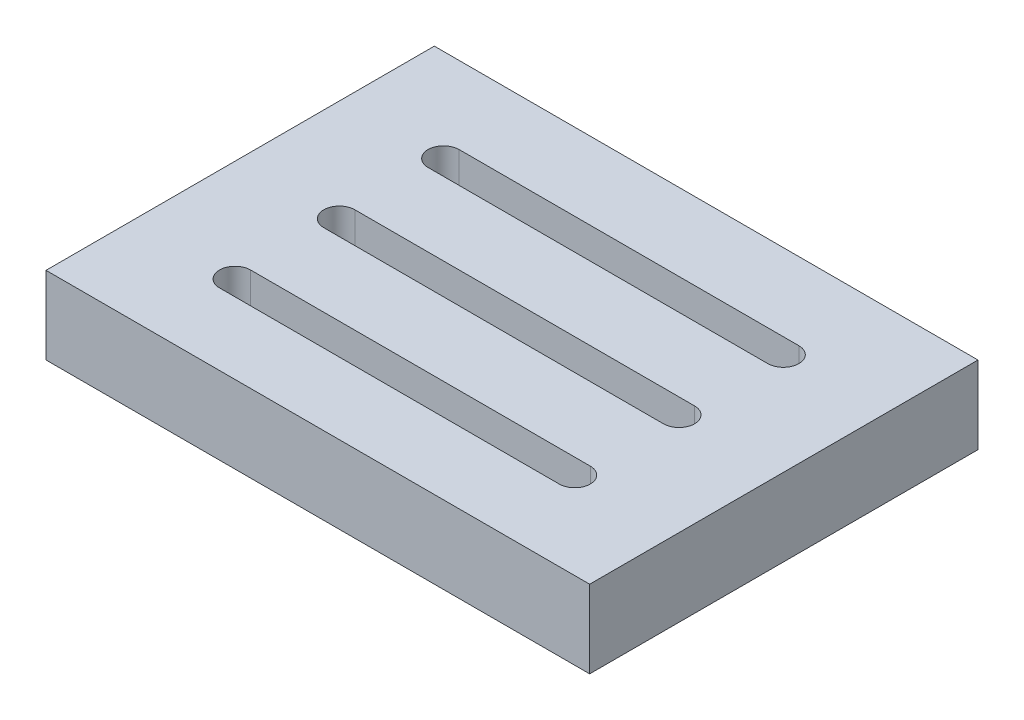
ISO-10303-21;
HEADER;
FILE_DESCRIPTION(('STEP AP214'),'2;1');
FILE_NAME('part.step','',(''),(''),'','','');
FILE_SCHEMA(('AUTOMOTIVE_DESIGN { 1 0 10303 214 1 1 1 1 }'));
ENDSEC;
DATA;
#1=APPLICATION_CONTEXT('core data for automotive mechanical design processes');
#2=APPLICATION_PROTOCOL_DEFINITION('international standard','automotive_design',2000,#1);
#3=PRODUCT_CONTEXT('',#1,'mechanical');
#4=PRODUCT('Part','Part','',(#3));
#5=PRODUCT_RELATED_PRODUCT_CATEGORY('part','',(#4));
#6=PRODUCT_DEFINITION_FORMATION('','',#4);
#7=PRODUCT_DEFINITION_CONTEXT('part definition',#1,'design');
#8=PRODUCT_DEFINITION('design','',#6,#7);
#9=PRODUCT_DEFINITION_SHAPE('','',#8);
#10=(LENGTH_UNIT() NAMED_UNIT(*) SI_UNIT(.MILLI.,.METRE.));
#11=(NAMED_UNIT(*) PLANE_ANGLE_UNIT() SI_UNIT($,.RADIAN.));
#12=(NAMED_UNIT(*) SI_UNIT($,.STERADIAN.) SOLID_ANGLE_UNIT());
#13=UNCERTAINTY_MEASURE_WITH_UNIT(LENGTH_MEASURE(1.E-05),#10,'distance_accuracy_value','');
#14=(GEOMETRIC_REPRESENTATION_CONTEXT(3) GLOBAL_UNCERTAINTY_ASSIGNED_CONTEXT((#13)) GLOBAL_UNIT_ASSIGNED_CONTEXT((#10,
#11,#12)) REPRESENTATION_CONTEXT('',''));
#15=CARTESIAN_POINT('',(0.,0.,0.));
#16=DIRECTION('',(0.,0.,1.));
#17=DIRECTION('',(1.,0.,0.));
#18=AXIS2_PLACEMENT_3D('',#15,#16,#17);
#19=CARTESIAN_POINT('',(35.,10.,-25.));
#20=DIRECTION('',(-1.,0.,0.));
#21=DIRECTION('',(0.,0.,1.));
#22=AXIS2_PLACEMENT_3D('',#19,#20,#21);
#23=PLANE('',#22);
#24=DIRECTION('',(0.,0.,-1.));
#25=VECTOR('',#24,1.);
#26=CARTESIAN_POINT('',(35.,0.,-25.));
#27=LINE('',#26,#25);
#28=CARTESIAN_POINT('',(35.,0.,25.));
#29=VERTEX_POINT('',#28);
#30=CARTESIAN_POINT('',(35.,0.,-25.));
#31=VERTEX_POINT('',#30);
#32=EDGE_CURVE('E199',#29,#31,#27,.T.);
#33=ORIENTED_EDGE('',*,*,#32,.T.);
#34=DIRECTION('',(0.,-1.,0.));
#35=VECTOR('',#34,1.);
#36=CARTESIAN_POINT('',(35.,10.,-25.));
#37=LINE('',#36,#35);
#38=CARTESIAN_POINT('',(35.,10.,-25.));
#39=VERTEX_POINT('',#38);
#40=EDGE_CURVE('E11',#39,#31,#37,.T.);
#41=ORIENTED_EDGE('',*,*,#40,.F.);
#42=DIRECTION('',(0.,0.,-1.));
#43=VECTOR('',#42,1.);
#44=CARTESIAN_POINT('',(35.,10.,-25.));
#45=LINE('',#44,#43);
#46=CARTESIAN_POINT('',(35.,10.,25.));
#47=VERTEX_POINT('',#46);
#48=EDGE_CURVE('E290',#47,#39,#45,.T.);
#49=ORIENTED_EDGE('',*,*,#48,.F.);
#50=DIRECTION('',(0.,-1.,0.));
#51=VECTOR('',#50,1.);
#52=CARTESIAN_POINT('',(35.,10.,25.));
#53=LINE('',#52,#51);
#54=EDGE_CURVE('E304',#47,#29,#53,.T.);
#55=ORIENTED_EDGE('',*,*,#54,.T.);
#56=EDGE_LOOP('',(#33,#41,#49,#55));
#57=FACE_BOUND('',#56,.T.);
#58=ADVANCED_FACE('F39',(#57),#23,.F.);
#59=CARTESIAN_POINT('',(-35.,10.,-25.));
#60=DIRECTION('',(0.,0.,1.));
#61=DIRECTION('',(1.,0.,0.));
#62=AXIS2_PLACEMENT_3D('',#59,#60,#61);
#63=PLANE('',#62);
#64=DIRECTION('',(-1.,0.,0.));
#65=VECTOR('',#64,1.);
#66=CARTESIAN_POINT('',(-35.,0.,-25.));
#67=LINE('',#66,#65);
#68=CARTESIAN_POINT('',(-35.,0.,-25.));
#69=VERTEX_POINT('',#68);
#70=EDGE_CURVE('E308',#31,#69,#67,.T.);
#71=ORIENTED_EDGE('',*,*,#70,.T.);
#72=DIRECTION('',(0.,-1.,0.));
#73=VECTOR('',#72,1.);
#74=CARTESIAN_POINT('',(-35.,10.,-25.));
#75=LINE('',#74,#73);
#76=CARTESIAN_POINT('',(-35.,10.,-25.));
#77=VERTEX_POINT('',#76);
#78=EDGE_CURVE('E47',#77,#69,#75,.T.);
#79=ORIENTED_EDGE('',*,*,#78,.F.);
#80=DIRECTION('',(-1.,0.,0.));
#81=VECTOR('',#80,1.);
#82=CARTESIAN_POINT('',(-35.,10.,-25.));
#83=LINE('',#82,#81);
#84=EDGE_CURVE('E294',#39,#77,#83,.T.);
#85=ORIENTED_EDGE('',*,*,#84,.F.);
#86=ORIENTED_EDGE('',*,*,#40,.T.);
#87=EDGE_LOOP('',(#71,#79,#85,#86));
#88=FACE_BOUND('',#87,.T.);
#89=ADVANCED_FACE('F343',(#88),#63,.F.);
#90=CARTESIAN_POINT('',(-35.,10.,-25.));
#91=DIRECTION('',(1.,0.,0.));
#92=DIRECTION('',(0.,0.,-1.));
#93=AXIS2_PLACEMENT_3D('',#90,#91,#92);
#94=PLANE('',#93);
#95=DIRECTION('',(0.,0.,1.));
#96=VECTOR('',#95,1.);
#97=CARTESIAN_POINT('',(-35.,0.,-25.));
#98=LINE('',#97,#96);
#99=CARTESIAN_POINT('',(-35.,0.,25.));
#100=VERTEX_POINT('',#99);
#101=EDGE_CURVE('E311',#69,#100,#98,.T.);
#102=ORIENTED_EDGE('',*,*,#101,.T.);
#103=DIRECTION('',(0.,-1.,0.));
#104=VECTOR('',#103,1.);
#105=CARTESIAN_POINT('',(-35.,10.,25.));
#106=LINE('',#105,#104);
#107=CARTESIAN_POINT('',(-35.,10.,25.));
#108=VERTEX_POINT('',#107);
#109=EDGE_CURVE('E319',#108,#100,#106,.T.);
#110=ORIENTED_EDGE('',*,*,#109,.F.);
#111=DIRECTION('',(0.,0.,1.));
#112=VECTOR('',#111,1.);
#113=CARTESIAN_POINT('',(-35.,10.,-25.));
#114=LINE('',#113,#112);
#115=EDGE_CURVE('E298',#77,#108,#114,.T.);
#116=ORIENTED_EDGE('',*,*,#115,.F.);
#117=ORIENTED_EDGE('',*,*,#78,.T.);
#118=EDGE_LOOP('',(#102,#110,#116,#117));
#119=FACE_BOUND('',#118,.T.);
#120=ADVANCED_FACE('F328',(#119),#94,.F.);
#121=CARTESIAN_POINT('',(-35.,10.,25.));
#122=DIRECTION('',(0.,0.,-1.));
#123=DIRECTION('',(-1.,0.,0.));
#124=AXIS2_PLACEMENT_3D('',#121,#122,#123);
#125=PLANE('',#124);
#126=DIRECTION('',(1.,0.,0.));
#127=VECTOR('',#126,1.);
#128=CARTESIAN_POINT('',(-35.,0.,25.));
#129=LINE('',#128,#127);
#130=EDGE_CURVE('E295',#100,#29,#129,.T.);
#131=ORIENTED_EDGE('',*,*,#130,.T.);
#132=ORIENTED_EDGE('',*,*,#54,.F.);
#133=DIRECTION('',(1.,0.,0.));
#134=VECTOR('',#133,1.);
#135=CARTESIAN_POINT('',(-35.,10.,25.));
#136=LINE('',#135,#134);
#137=EDGE_CURVE('E301',#108,#47,#136,.T.);
#138=ORIENTED_EDGE('',*,*,#137,.F.);
#139=ORIENTED_EDGE('',*,*,#109,.T.);
#140=EDGE_LOOP('',(#131,#132,#138,#139));
#141=FACE_BOUND('',#140,.T.);
#142=ADVANCED_FACE('F336',(#141),#125,.F.);
#143=CARTESIAN_POINT('',(0.,10.,0.));
#144=DIRECTION('',(0.,1.,0.));
#145=DIRECTION('',(0.,0.,1.));
#146=AXIS2_PLACEMENT_3D('',#143,#144,#145);
#147=PLANE('',#146);
#148=CARTESIAN_POINT('',(-21.8711859678488,10.,-13.0643372737734));
#149=DIRECTION('',(0.,1.,0.));
#150=DIRECTION('',(0.,0.,1.));
#151=AXIS2_PLACEMENT_3D('',#148,#149,#150);
#152=CIRCLE('',#151,2.);
#153=CARTESIAN_POINT('',(-21.8711859678488,10.,-15.0643372737734));
#154=VERTEX_POINT('',#153);
#155=CARTESIAN_POINT('',(-21.8711859678488,10.,-11.0643372737734));
#156=VERTEX_POINT('',#155);
#157=EDGE_CURVE('E54',#154,#156,#152,.T.);
#158=ORIENTED_EDGE('',*,*,#157,.F.);
#159=DIRECTION('',(-1.,0.,0.));
#160=VECTOR('',#159,1.);
#161=CARTESIAN_POINT('',(-21.8711859678488,10.,-15.0643372737734));
#162=LINE('',#161,#160);
#163=CARTESIAN_POINT('',(21.8711859678488,10.,-15.0643372737734));
#164=VERTEX_POINT('',#163);
#165=EDGE_CURVE('E176',#164,#154,#162,.T.);
#166=ORIENTED_EDGE('',*,*,#165,.F.);
#167=CARTESIAN_POINT('',(21.8711859678488,10.,-13.0643372737734));
#168=DIRECTION('',(0.,1.,0.));
#169=DIRECTION('',(0.,0.,1.));
#170=AXIS2_PLACEMENT_3D('',#167,#168,#169);
#171=CIRCLE('',#170,2.);
#172=CARTESIAN_POINT('',(21.8711859678488,10.,-11.0643372737734));
#173=VERTEX_POINT('',#172);
#174=EDGE_CURVE('E180',#173,#164,#171,.T.);
#175=ORIENTED_EDGE('',*,*,#174,.F.);
#176=DIRECTION('',(1.,0.,0.));
#177=VECTOR('',#176,1.);
#178=CARTESIAN_POINT('',(-21.8711859678488,10.,-11.0643372737734));
#179=LINE('',#178,#177);
#180=EDGE_CURVE('E189',#156,#173,#179,.T.);
#181=ORIENTED_EDGE('',*,*,#180,.F.);
#182=EDGE_LOOP('',(#158,#166,#175,#181));
#183=FACE_BOUND('',#182,.T.);
#184=CARTESIAN_POINT('',(-21.8711859678488,10.,13.7910985574967));
#185=DIRECTION('',(0.,1.,0.));
#186=DIRECTION('',(0.,0.,1.));
#187=AXIS2_PLACEMENT_3D('',#184,#185,#186);
#188=CIRCLE('',#187,2.);
#189=CARTESIAN_POINT('',(-21.8711859678488,10.,11.7910985574967));
#190=VERTEX_POINT('',#189);
#191=CARTESIAN_POINT('',(-21.8711859678488,10.,15.7910985574967));
#192=VERTEX_POINT('',#191);
#193=EDGE_CURVE('E62',#190,#192,#188,.T.);
#194=ORIENTED_EDGE('',*,*,#193,.F.);
#195=DIRECTION('',(-1.,0.,0.));
#196=VECTOR('',#195,1.);
#197=CARTESIAN_POINT('',(-21.8711859678488,10.,11.7910985574967));
#198=LINE('',#197,#196);
#199=CARTESIAN_POINT('',(21.8711859678488,10.,11.7910985574967));
#200=VERTEX_POINT('',#199);
#201=EDGE_CURVE('E210',#200,#190,#198,.T.);
#202=ORIENTED_EDGE('',*,*,#201,.F.);
#203=CARTESIAN_POINT('',(21.8711859678488,10.,13.7910985574967));
#204=DIRECTION('',(0.,1.,0.));
#205=DIRECTION('',(0.,0.,1.));
#206=AXIS2_PLACEMENT_3D('',#203,#204,#205);
#207=CIRCLE('',#206,2.);
#208=CARTESIAN_POINT('',(21.8711859678488,10.,15.7910985574967));
#209=VERTEX_POINT('',#208);
#210=EDGE_CURVE('E230',#209,#200,#207,.T.);
#211=ORIENTED_EDGE('',*,*,#210,.F.);
#212=DIRECTION('',(1.,0.,0.));
#213=VECTOR('',#212,1.);
#214=CARTESIAN_POINT('',(-21.8711859678488,10.,15.7910985574967));
#215=LINE('',#214,#213);
#216=EDGE_CURVE('E225',#192,#209,#215,.T.);
#217=ORIENTED_EDGE('',*,*,#216,.F.);
#218=EDGE_LOOP('',(#194,#202,#211,#217));
#219=FACE_BOUND('',#218,.T.);
#220=CARTESIAN_POINT('',(-21.8711859678488,10.,0.363380641861649));
#221=DIRECTION('',(0.,1.,0.));
#222=DIRECTION('',(0.,0.,1.));
#223=AXIS2_PLACEMENT_3D('',#220,#221,#222);
#224=CIRCLE('',#223,2.);
#225=CARTESIAN_POINT('',(-21.8711859678488,10.,-1.63661935813835));
#226=VERTEX_POINT('',#225);
#227=CARTESIAN_POINT('',(-21.8711859678488,10.,2.36338064186165));
#228=VERTEX_POINT('',#227);
#229=EDGE_CURVE('E265',#226,#228,#224,.T.);
#230=ORIENTED_EDGE('',*,*,#229,.F.);
#231=DIRECTION('',(-1.,0.,0.));
#232=VECTOR('',#231,1.);
#233=CARTESIAN_POINT('',(-21.8711859678488,10.,-1.63661935813835));
#234=LINE('',#233,#232);
#235=CARTESIAN_POINT('',(21.8711859678488,10.,-1.63661935813835));
#236=VERTEX_POINT('',#235);
#237=EDGE_CURVE('E252',#236,#226,#234,.T.);
#238=ORIENTED_EDGE('',*,*,#237,.F.);
#239=CARTESIAN_POINT('',(21.8711859678488,10.,0.363380641861649));
#240=DIRECTION('',(0.,1.,0.));
#241=DIRECTION('',(0.,0.,1.));
#242=AXIS2_PLACEMENT_3D('',#239,#240,#241);
#243=CIRCLE('',#242,2.);
#244=CARTESIAN_POINT('',(21.8711859678488,10.,2.36338064186165));
#245=VERTEX_POINT('',#244);
#246=EDGE_CURVE('E272',#245,#236,#243,.T.);
#247=ORIENTED_EDGE('',*,*,#246,.F.);
#248=DIRECTION('',(1.,0.,0.));
#249=VECTOR('',#248,1.);
#250=CARTESIAN_POINT('',(-21.8711859678488,10.,2.36338064186165));
#251=LINE('',#250,#249);
#252=EDGE_CURVE('E268',#228,#245,#251,.T.);
#253=ORIENTED_EDGE('',*,*,#252,.F.);
#254=EDGE_LOOP('',(#230,#238,#247,#253));
#255=FACE_BOUND('',#254,.T.);
#256=ORIENTED_EDGE('',*,*,#48,.T.);
#257=ORIENTED_EDGE('',*,*,#84,.T.);
#258=ORIENTED_EDGE('',*,*,#115,.T.);
#259=ORIENTED_EDGE('',*,*,#137,.T.);
#260=EDGE_LOOP('',(#256,#257,#258,#259));
#261=FACE_BOUND('',#260,.T.);
#262=ADVANCED_FACE('F342',(#183,#219,#255,#261),#147,.T.);
#263=CARTESIAN_POINT('',(0.,0.,0.));
#264=DIRECTION('',(0.,1.,0.));
#265=DIRECTION('',(0.,0.,1.));
#266=AXIS2_PLACEMENT_3D('',#263,#264,#265);
#267=PLANE('',#266);
#268=DIRECTION('',(-1.,0.,0.));
#269=VECTOR('',#268,1.);
#270=CARTESIAN_POINT('',(-21.8711859678488,0.,-15.0643372737734));
#271=LINE('',#270,#269);
#272=CARTESIAN_POINT('',(21.8711859678488,0.,-15.0643372737734));
#273=VERTEX_POINT('',#272);
#274=CARTESIAN_POINT('',(-21.8711859678488,0.,-15.0643372737734));
#275=VERTEX_POINT('',#274);
#276=EDGE_CURVE('E161',#273,#275,#271,.T.);
#277=ORIENTED_EDGE('',*,*,#276,.T.);
#278=CARTESIAN_POINT('',(-21.8711859678488,0.,-13.0643372737734));
#279=DIRECTION('',(0.,1.,0.));
#280=DIRECTION('',(0.,0.,1.));
#281=AXIS2_PLACEMENT_3D('',#278,#279,#280);
#282=CIRCLE('',#281,2.);
#283=CARTESIAN_POINT('',(-21.8711859678488,0.,-11.0643372737734));
#284=VERTEX_POINT('',#283);
#285=EDGE_CURVE('E154',#275,#284,#282,.T.);
#286=ORIENTED_EDGE('',*,*,#285,.T.);
#287=DIRECTION('',(1.,0.,0.));
#288=VECTOR('',#287,1.);
#289=CARTESIAN_POINT('',(-21.8711859678488,0.,-11.0643372737734));
#290=LINE('',#289,#288);
#291=CARTESIAN_POINT('',(21.8711859678488,0.,-11.0643372737734));
#292=VERTEX_POINT('',#291);
#293=EDGE_CURVE('E165',#284,#292,#290,.T.);
#294=ORIENTED_EDGE('',*,*,#293,.T.);
#295=CARTESIAN_POINT('',(21.8711859678488,0.,-13.0643372737734));
#296=DIRECTION('',(0.,1.,0.));
#297=DIRECTION('',(0.,0.,1.));
#298=AXIS2_PLACEMENT_3D('',#295,#296,#297);
#299=CIRCLE('',#298,2.);
#300=EDGE_CURVE('E170',#292,#273,#299,.T.);
#301=ORIENTED_EDGE('',*,*,#300,.T.);
#302=EDGE_LOOP('',(#277,#286,#294,#301));
#303=FACE_BOUND('',#302,.T.);
#304=DIRECTION('',(-1.,0.,0.));
#305=VECTOR('',#304,1.);
#306=CARTESIAN_POINT('',(-21.8711859678488,0.,11.7910985574967));
#307=LINE('',#306,#305);
#308=CARTESIAN_POINT('',(21.8711859678488,0.,11.7910985574967));
#309=VERTEX_POINT('',#308);
#310=CARTESIAN_POINT('',(-21.8711859678488,0.,11.7910985574967));
#311=VERTEX_POINT('',#310);
#312=EDGE_CURVE('E218',#309,#311,#307,.T.);
#313=ORIENTED_EDGE('',*,*,#312,.T.);
#314=CARTESIAN_POINT('',(-21.8711859678488,0.,13.7910985574967));
#315=DIRECTION('',(0.,1.,0.));
#316=DIRECTION('',(0.,0.,1.));
#317=AXIS2_PLACEMENT_3D('',#314,#315,#316);
#318=CIRCLE('',#317,2.);
#319=CARTESIAN_POINT('',(-21.8711859678488,0.,15.7910985574967));
#320=VERTEX_POINT('',#319);
#321=EDGE_CURVE('E205',#311,#320,#318,.T.);
#322=ORIENTED_EDGE('',*,*,#321,.T.);
#323=DIRECTION('',(1.,0.,0.));
#324=VECTOR('',#323,1.);
#325=CARTESIAN_POINT('',(-21.8711859678488,0.,15.7910985574967));
#326=LINE('',#325,#324);
#327=CARTESIAN_POINT('',(21.8711859678488,0.,15.7910985574967));
#328=VERTEX_POINT('',#327);
#329=EDGE_CURVE('E209',#320,#328,#326,.T.);
#330=ORIENTED_EDGE('',*,*,#329,.T.);
#331=CARTESIAN_POINT('',(21.8711859678488,0.,13.7910985574967));
#332=DIRECTION('',(0.,1.,0.));
#333=DIRECTION('',(0.,0.,1.));
#334=AXIS2_PLACEMENT_3D('',#331,#332,#333);
#335=CIRCLE('',#334,2.);
#336=EDGE_CURVE('E214',#328,#309,#335,.T.);
#337=ORIENTED_EDGE('',*,*,#336,.T.);
#338=EDGE_LOOP('',(#313,#322,#330,#337));
#339=FACE_BOUND('',#338,.T.);
#340=DIRECTION('',(-1.,0.,0.));
#341=VECTOR('',#340,1.);
#342=CARTESIAN_POINT('',(-21.8711859678488,0.,-1.63661935813835));
#343=LINE('',#342,#341);
#344=CARTESIAN_POINT('',(21.8711859678488,0.,-1.63661935813835));
#345=VERTEX_POINT('',#344);
#346=CARTESIAN_POINT('',(-21.8711859678488,0.,-1.63661935813835));
#347=VERTEX_POINT('',#346);
#348=EDGE_CURVE('E260',#345,#347,#343,.T.);
#349=ORIENTED_EDGE('',*,*,#348,.T.);
#350=CARTESIAN_POINT('',(-21.8711859678488,0.,0.363380641861649));
#351=DIRECTION('',(0.,1.,0.));
#352=DIRECTION('',(0.,0.,1.));
#353=AXIS2_PLACEMENT_3D('',#350,#351,#352);
#354=CIRCLE('',#353,2.);
#355=CARTESIAN_POINT('',(-21.8711859678488,0.,2.36338064186165));
#356=VERTEX_POINT('',#355);
#357=EDGE_CURVE('E247',#347,#356,#354,.T.);
#358=ORIENTED_EDGE('',*,*,#357,.T.);
#359=DIRECTION('',(1.,0.,0.));
#360=VECTOR('',#359,1.);
#361=CARTESIAN_POINT('',(-21.8711859678488,0.,2.36338064186165));
#362=LINE('',#361,#360);
#363=CARTESIAN_POINT('',(21.8711859678488,0.,2.36338064186165));
#364=VERTEX_POINT('',#363);
#365=EDGE_CURVE('E251',#356,#364,#362,.T.);
#366=ORIENTED_EDGE('',*,*,#365,.T.);
#367=CARTESIAN_POINT('',(21.8711859678488,0.,0.363380641861649));
#368=DIRECTION('',(0.,1.,0.));
#369=DIRECTION('',(0.,0.,1.));
#370=AXIS2_PLACEMENT_3D('',#367,#368,#369);
#371=CIRCLE('',#370,2.);
#372=EDGE_CURVE('E256',#364,#345,#371,.T.);
#373=ORIENTED_EDGE('',*,*,#372,.T.);
#374=EDGE_LOOP('',(#349,#358,#366,#373));
#375=FACE_BOUND('',#374,.T.);
#376=ORIENTED_EDGE('',*,*,#32,.F.);
#377=ORIENTED_EDGE('',*,*,#130,.F.);
#378=ORIENTED_EDGE('',*,*,#101,.F.);
#379=ORIENTED_EDGE('',*,*,#70,.F.);
#380=EDGE_LOOP('',(#376,#377,#378,#379));
#381=FACE_BOUND('',#380,.T.);
#382=ADVANCED_FACE('F172',(#303,#339,#375,#381),#267,.F.);
#383=CARTESIAN_POINT('',(-21.8711859678488,0.,0.363380641861649));
#384=DIRECTION('',(0.,1.,0.));
#385=DIRECTION('',(0.,0.,1.));
#386=AXIS2_PLACEMENT_3D('',#383,#384,#385);
#387=CYLINDRICAL_SURFACE('',#386,2.);
#388=ORIENTED_EDGE('',*,*,#229,.T.);
#389=DIRECTION('',(0.,1.,0.));
#390=VECTOR('',#389,1.);
#391=CARTESIAN_POINT('',(-21.8711859678488,0.,2.36338064186165));
#392=LINE('',#391,#390);
#393=EDGE_CURVE('E264',#356,#228,#392,.T.);
#394=ORIENTED_EDGE('',*,*,#393,.F.);
#395=ORIENTED_EDGE('',*,*,#357,.F.);
#396=DIRECTION('',(0.,1.,0.));
#397=VECTOR('',#396,1.);
#398=CARTESIAN_POINT('',(-21.8711859678488,0.,-1.63661935813835));
#399=LINE('',#398,#397);
#400=EDGE_CURVE('E226',#347,#226,#399,.T.);
#401=ORIENTED_EDGE('',*,*,#400,.T.);
#402=EDGE_LOOP('',(#388,#394,#395,#401));
#403=FACE_BOUND('',#402,.T.);
#404=ADVANCED_FACE('F355',(#403),#387,.F.);
#405=CARTESIAN_POINT('',(-21.8711859678488,0.,-1.63661935813835));
#406=DIRECTION('',(0.,0.,-1.));
#407=DIRECTION('',(-1.,0.,0.));
#408=AXIS2_PLACEMENT_3D('',#405,#406,#407);
#409=PLANE('',#408);
#410=ORIENTED_EDGE('',*,*,#237,.T.);
#411=ORIENTED_EDGE('',*,*,#400,.F.);
#412=ORIENTED_EDGE('',*,*,#348,.F.);
#413=DIRECTION('',(0.,1.,0.));
#414=VECTOR('',#413,1.);
#415=CARTESIAN_POINT('',(21.8711859678488,0.,-1.63661935813835));
#416=LINE('',#415,#414);
#417=EDGE_CURVE('E281',#345,#236,#416,.T.);
#418=ORIENTED_EDGE('',*,*,#417,.T.);
#419=EDGE_LOOP('',(#410,#411,#412,#418));
#420=FACE_BOUND('',#419,.T.);
#421=ADVANCED_FACE('F361',(#420),#409,.F.);
#422=CARTESIAN_POINT('',(21.8711859678488,0.,0.363380641861649));
#423=DIRECTION('',(0.,1.,0.));
#424=DIRECTION('',(0.,0.,1.));
#425=AXIS2_PLACEMENT_3D('',#422,#423,#424);
#426=CYLINDRICAL_SURFACE('',#425,2.);
#427=ORIENTED_EDGE('',*,*,#246,.T.);
#428=ORIENTED_EDGE('',*,*,#417,.F.);
#429=ORIENTED_EDGE('',*,*,#372,.F.);
#430=DIRECTION('',(0.,1.,0.));
#431=VECTOR('',#430,1.);
#432=CARTESIAN_POINT('',(21.8711859678488,0.,2.36338064186165));
#433=LINE('',#432,#431);
#434=EDGE_CURVE('E284',#364,#245,#433,.T.);
#435=ORIENTED_EDGE('',*,*,#434,.T.);
#436=EDGE_LOOP('',(#427,#428,#429,#435));
#437=FACE_BOUND('',#436,.T.);
#438=ADVANCED_FACE('F367',(#437),#426,.F.);
#439=CARTESIAN_POINT('',(-21.8711859678488,0.,2.36338064186165));
#440=DIRECTION('',(0.,0.,1.));
#441=DIRECTION('',(1.,0.,0.));
#442=AXIS2_PLACEMENT_3D('',#439,#440,#441);
#443=PLANE('',#442);
#444=ORIENTED_EDGE('',*,*,#252,.T.);
#445=ORIENTED_EDGE('',*,*,#434,.F.);
#446=ORIENTED_EDGE('',*,*,#365,.F.);
#447=ORIENTED_EDGE('',*,*,#393,.T.);
#448=EDGE_LOOP('',(#444,#445,#446,#447));
#449=FACE_BOUND('',#448,.T.);
#450=ADVANCED_FACE('F363',(#449),#443,.F.);
#451=CARTESIAN_POINT('',(-21.8711859678488,0.,13.7910985574967));
#452=DIRECTION('',(0.,1.,0.));
#453=DIRECTION('',(0.,0.,1.));
#454=AXIS2_PLACEMENT_3D('',#451,#452,#453);
#455=CYLINDRICAL_SURFACE('',#454,2.);
#456=ORIENTED_EDGE('',*,*,#193,.T.);
#457=DIRECTION('',(0.,1.,0.));
#458=VECTOR('',#457,1.);
#459=CARTESIAN_POINT('',(-21.8711859678488,0.,15.7910985574967));
#460=LINE('',#459,#458);
#461=EDGE_CURVE('E222',#320,#192,#460,.T.);
#462=ORIENTED_EDGE('',*,*,#461,.F.);
#463=ORIENTED_EDGE('',*,*,#321,.F.);
#464=DIRECTION('',(0.,1.,0.));
#465=VECTOR('',#464,1.);
#466=CARTESIAN_POINT('',(-21.8711859678488,0.,11.7910985574967));
#467=LINE('',#466,#465);
#468=EDGE_CURVE('E190',#311,#190,#467,.T.);
#469=ORIENTED_EDGE('',*,*,#468,.T.);
#470=EDGE_LOOP('',(#456,#462,#463,#469));
#471=FACE_BOUND('',#470,.T.);
#472=ADVANCED_FACE('F366',(#471),#455,.F.);
#473=CARTESIAN_POINT('',(-21.8711859678488,0.,11.7910985574967));
#474=DIRECTION('',(0.,0.,-1.));
#475=DIRECTION('',(-1.,0.,0.));
#476=AXIS2_PLACEMENT_3D('',#473,#474,#475);
#477=PLANE('',#476);
#478=ORIENTED_EDGE('',*,*,#201,.T.);
#479=ORIENTED_EDGE('',*,*,#468,.F.);
#480=ORIENTED_EDGE('',*,*,#312,.F.);
#481=DIRECTION('',(0.,1.,0.));
#482=VECTOR('',#481,1.);
#483=CARTESIAN_POINT('',(21.8711859678488,0.,11.7910985574967));
#484=LINE('',#483,#482);
#485=EDGE_CURVE('E239',#309,#200,#484,.T.);
#486=ORIENTED_EDGE('',*,*,#485,.T.);
#487=EDGE_LOOP('',(#478,#479,#480,#486));
#488=FACE_BOUND('',#487,.T.);
#489=ADVANCED_FACE('F377',(#488),#477,.F.);
#490=CARTESIAN_POINT('',(21.8711859678488,0.,13.7910985574967));
#491=DIRECTION('',(0.,1.,0.));
#492=DIRECTION('',(0.,0.,1.));
#493=AXIS2_PLACEMENT_3D('',#490,#491,#492);
#494=CYLINDRICAL_SURFACE('',#493,2.);
#495=ORIENTED_EDGE('',*,*,#210,.T.);
#496=ORIENTED_EDGE('',*,*,#485,.F.);
#497=ORIENTED_EDGE('',*,*,#336,.F.);
#498=DIRECTION('',(0.,1.,0.));
#499=VECTOR('',#498,1.);
#500=CARTESIAN_POINT('',(21.8711859678488,0.,15.7910985574967));
#501=LINE('',#500,#499);
#502=EDGE_CURVE('E242',#328,#209,#501,.T.);
#503=ORIENTED_EDGE('',*,*,#502,.T.);
#504=EDGE_LOOP('',(#495,#496,#497,#503));
#505=FACE_BOUND('',#504,.T.);
#506=ADVANCED_FACE('F381',(#505),#494,.F.);
#507=CARTESIAN_POINT('',(-21.8711859678488,0.,15.7910985574967));
#508=DIRECTION('',(0.,0.,1.));
#509=DIRECTION('',(1.,0.,0.));
#510=AXIS2_PLACEMENT_3D('',#507,#508,#509);
#511=PLANE('',#510);
#512=ORIENTED_EDGE('',*,*,#216,.T.);
#513=ORIENTED_EDGE('',*,*,#502,.F.);
#514=ORIENTED_EDGE('',*,*,#329,.F.);
#515=ORIENTED_EDGE('',*,*,#461,.T.);
#516=EDGE_LOOP('',(#512,#513,#514,#515));
#517=FACE_BOUND('',#516,.T.);
#518=ADVANCED_FACE('F378',(#517),#511,.F.);
#519=CARTESIAN_POINT('',(-21.8711859678488,0.,-13.0643372737734));
#520=DIRECTION('',(0.,1.,0.));
#521=DIRECTION('',(0.,0.,1.));
#522=AXIS2_PLACEMENT_3D('',#519,#520,#521);
#523=CYLINDRICAL_SURFACE('',#522,2.);
#524=ORIENTED_EDGE('',*,*,#157,.T.);
#525=DIRECTION('',(0.,1.,0.));
#526=VECTOR('',#525,1.);
#527=CARTESIAN_POINT('',(-21.8711859678488,0.,-11.0643372737734));
#528=LINE('',#527,#526);
#529=EDGE_CURVE('E150',#284,#156,#528,.T.);
#530=ORIENTED_EDGE('',*,*,#529,.F.);
#531=ORIENTED_EDGE('',*,*,#285,.F.);
#532=DIRECTION('',(0.,1.,0.));
#533=VECTOR('',#532,1.);
#534=CARTESIAN_POINT('',(-21.8711859678488,0.,-15.0643372737734));
#535=LINE('',#534,#533);
#536=EDGE_CURVE('E196',#275,#154,#535,.T.);
#537=ORIENTED_EDGE('',*,*,#536,.T.);
#538=EDGE_LOOP('',(#524,#530,#531,#537));
#539=FACE_BOUND('',#538,.T.);
#540=ADVANCED_FACE('F152',(#539),#523,.F.);
#541=CARTESIAN_POINT('',(-21.8711859678488,0.,-15.0643372737734));
#542=DIRECTION('',(0.,0.,-1.));
#543=DIRECTION('',(-1.,0.,0.));
#544=AXIS2_PLACEMENT_3D('',#541,#542,#543);
#545=PLANE('',#544);
#546=ORIENTED_EDGE('',*,*,#165,.T.);
#547=ORIENTED_EDGE('',*,*,#536,.F.);
#548=ORIENTED_EDGE('',*,*,#276,.F.);
#549=DIRECTION('',(0.,1.,0.));
#550=VECTOR('',#549,1.);
#551=CARTESIAN_POINT('',(21.8711859678488,0.,-15.0643372737734));
#552=LINE('',#551,#550);
#553=EDGE_CURVE('E200',#273,#164,#552,.T.);
#554=ORIENTED_EDGE('',*,*,#553,.T.);
#555=EDGE_LOOP('',(#546,#547,#548,#554));
#556=FACE_BOUND('',#555,.T.);
#557=ADVANCED_FACE('F391',(#556),#545,.F.);
#558=CARTESIAN_POINT('',(21.8711859678488,0.,-13.0643372737734));
#559=DIRECTION('',(0.,1.,0.));
#560=DIRECTION('',(0.,0.,1.));
#561=AXIS2_PLACEMENT_3D('',#558,#559,#560);
#562=CYLINDRICAL_SURFACE('',#561,2.);
#563=ORIENTED_EDGE('',*,*,#174,.T.);
#564=ORIENTED_EDGE('',*,*,#553,.F.);
#565=ORIENTED_EDGE('',*,*,#300,.F.);
#566=DIRECTION('',(0.,1.,0.));
#567=VECTOR('',#566,1.);
#568=CARTESIAN_POINT('',(21.8711859678488,0.,-11.0643372737734));
#569=LINE('',#568,#567);
#570=EDGE_CURVE('E160',#292,#173,#569,.T.);
#571=ORIENTED_EDGE('',*,*,#570,.T.);
#572=EDGE_LOOP('',(#563,#564,#565,#571));
#573=FACE_BOUND('',#572,.T.);
#574=ADVANCED_FACE('F394',(#573),#562,.F.);
#575=CARTESIAN_POINT('',(-21.8711859678488,0.,-11.0643372737734));
#576=DIRECTION('',(0.,0.,1.));
#577=DIRECTION('',(1.,0.,0.));
#578=AXIS2_PLACEMENT_3D('',#575,#576,#577);
#579=PLANE('',#578);
#580=ORIENTED_EDGE('',*,*,#180,.T.);
#581=ORIENTED_EDGE('',*,*,#570,.F.);
#582=ORIENTED_EDGE('',*,*,#293,.F.);
#583=ORIENTED_EDGE('',*,*,#529,.T.);
#584=EDGE_LOOP('',(#580,#581,#582,#583));
#585=FACE_BOUND('',#584,.T.);
#586=ADVANCED_FACE('F166',(#585),#579,.F.);
#587=CLOSED_SHELL('',(#58,#89,#120,#142,#262,#382,#404,#421,#438,#450,#472,#489,#506,#518,#540,
#557,#574,#586));
#588=MANIFOLD_SOLID_BREP('B2',#587);
#589=ADVANCED_BREP_SHAPE_REPRESENTATION('',(#18,#588),#14);
#590=SHAPE_DEFINITION_REPRESENTATION(#9,#589);
ENDSEC;
END-ISO-10303-21;
